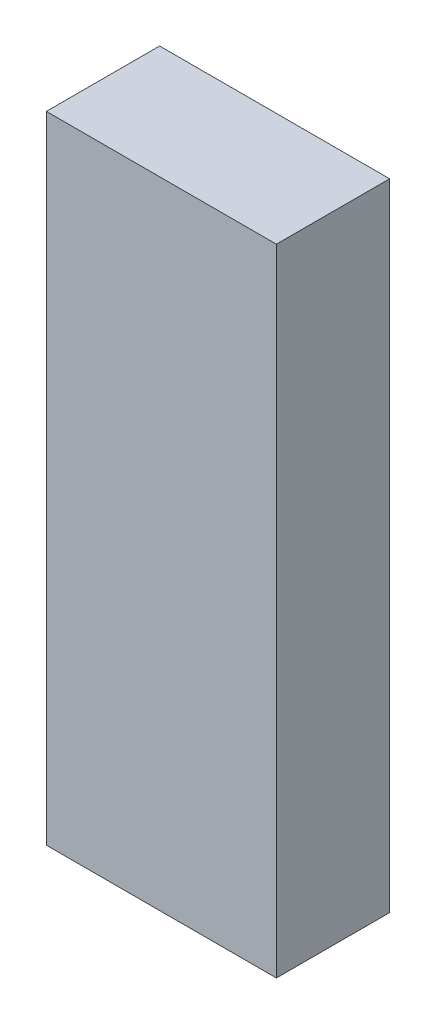
ISO-10303-21;
HEADER;
FILE_DESCRIPTION(('STEP AP214'),'2;1');
FILE_NAME('part.step','',(''),(''),'','','');
FILE_SCHEMA(('AUTOMOTIVE_DESIGN { 1 0 10303 214 1 1 1 1 }'));
ENDSEC;
DATA;
#1=APPLICATION_CONTEXT('core data for automotive mechanical design processes');
#2=APPLICATION_PROTOCOL_DEFINITION('international standard','automotive_design',2000,#1);
#3=PRODUCT_CONTEXT('',#1,'mechanical');
#4=PRODUCT('Part','Part','',(#3));
#5=PRODUCT_RELATED_PRODUCT_CATEGORY('part','',(#4));
#6=PRODUCT_DEFINITION_FORMATION('','',#4);
#7=PRODUCT_DEFINITION_CONTEXT('part definition',#1,'design');
#8=PRODUCT_DEFINITION('design','',#6,#7);
#9=PRODUCT_DEFINITION_SHAPE('','',#8);
#10=(LENGTH_UNIT() NAMED_UNIT(*) SI_UNIT(.MILLI.,.METRE.));
#11=(NAMED_UNIT(*) PLANE_ANGLE_UNIT() SI_UNIT($,.RADIAN.));
#12=(NAMED_UNIT(*) SI_UNIT($,.STERADIAN.) SOLID_ANGLE_UNIT());
#13=UNCERTAINTY_MEASURE_WITH_UNIT(LENGTH_MEASURE(1.E-05),#10,'distance_accuracy_value','');
#14=(GEOMETRIC_REPRESENTATION_CONTEXT(3) GLOBAL_UNCERTAINTY_ASSIGNED_CONTEXT((#13)) GLOBAL_UNIT_ASSIGNED_CONTEXT((#10,
#11,#12)) REPRESENTATION_CONTEXT('',''));
#15=CARTESIAN_POINT('',(0.,0.,0.));
#16=DIRECTION('',(0.,0.,1.));
#17=DIRECTION('',(1.,0.,0.));
#18=AXIS2_PLACEMENT_3D('',#15,#16,#17);
#19=CARTESIAN_POINT('',(-0.32500316,0.45719492,0.31999936));
#20=DIRECTION('',(0.,0.,-1.));
#21=DIRECTION('',(-1.,0.,0.));
#22=AXIS2_PLACEMENT_3D('',#19,#20,#21);
#23=PLANE('',#22);
#24=DIRECTION('',(0.,1.,0.));
#25=VECTOR('',#24,1.);
#26=CARTESIAN_POINT('',(0.32499808,-1.3386308,0.31999936));
#27=LINE('',#26,#25);
#28=CARTESIAN_POINT('',(0.32499808,-1.3386308,0.31999936));
#29=VERTEX_POINT('',#28);
#30=CARTESIAN_POINT('',(0.32499808,0.45719492,0.31999936));
#31=VERTEX_POINT('',#30);
#32=EDGE_CURVE('E79',#29,#31,#27,.T.);
#33=ORIENTED_EDGE('',*,*,#32,.T.);
#34=DIRECTION('',(1.,0.,0.));
#35=VECTOR('',#34,1.);
#36=CARTESIAN_POINT('',(0.32499808,0.45719492,0.31999936));
#37=LINE('',#36,#35);
#38=CARTESIAN_POINT('',(-0.32500316,0.45719492,0.31999936));
#39=VERTEX_POINT('',#38);
#40=EDGE_CURVE('E54',#31,#39,#37,.F.);
#41=ORIENTED_EDGE('',*,*,#40,.T.);
#42=DIRECTION('',(0.,1.,0.));
#43=VECTOR('',#42,1.);
#44=CARTESIAN_POINT('',(-0.32500316,0.45719492,0.31999936));
#45=LINE('',#44,#43);
#46=CARTESIAN_POINT('',(-0.32500316,-1.3386308,0.31999936));
#47=VERTEX_POINT('',#46);
#48=EDGE_CURVE('E56',#39,#47,#45,.F.);
#49=ORIENTED_EDGE('',*,*,#48,.T.);
#50=DIRECTION('',(1.,0.,0.));
#51=VECTOR('',#50,1.);
#52=CARTESIAN_POINT('',(-0.32500316,-1.3386308,0.31999936));
#53=LINE('',#52,#51);
#54=EDGE_CURVE('E19',#47,#29,#53,.T.);
#55=ORIENTED_EDGE('',*,*,#54,.T.);
#56=EDGE_LOOP('',(#33,#41,#49,#55));
#57=FACE_BOUND('',#56,.T.);
#58=ADVANCED_FACE('F16',(#57),#23,.F.);
#59=CARTESIAN_POINT('',(-0.32500316,-1.3386308,0.));
#60=DIRECTION('',(0.,1.,0.));
#61=DIRECTION('',(0.,0.,1.));
#62=AXIS2_PLACEMENT_3D('',#59,#60,#61);
#63=PLANE('',#62);
#64=ORIENTED_EDGE('',*,*,#54,.F.);
#65=DIRECTION('',(0.,0.,-1.));
#66=VECTOR('',#65,1.);
#67=CARTESIAN_POINT('',(-0.32500316,-1.3386308,0.));
#68=LINE('',#67,#66);
#69=CARTESIAN_POINT('',(-0.32500316,-1.3386308,0.));
#70=VERTEX_POINT('',#69);
#71=EDGE_CURVE('E62',#47,#70,#68,.T.);
#72=ORIENTED_EDGE('',*,*,#71,.T.);
#73=DIRECTION('',(-1.,0.,0.));
#74=VECTOR('',#73,1.);
#75=CARTESIAN_POINT('',(-0.32500316,-1.3386308,0.));
#76=LINE('',#75,#74);
#77=CARTESIAN_POINT('',(0.32499808,-1.3386308,0.));
#78=VERTEX_POINT('',#77);
#79=EDGE_CURVE('E82',#78,#70,#76,.T.);
#80=ORIENTED_EDGE('',*,*,#79,.F.);
#81=DIRECTION('',(0.,0.,1.));
#82=VECTOR('',#81,1.);
#83=CARTESIAN_POINT('',(0.32499808,-1.3386308,0.));
#84=LINE('',#83,#82);
#85=EDGE_CURVE('E67',#78,#29,#84,.T.);
#86=ORIENTED_EDGE('',*,*,#85,.T.);
#87=EDGE_LOOP('',(#64,#72,#80,#86));
#88=FACE_BOUND('',#87,.T.);
#89=ADVANCED_FACE('F64',(#88),#63,.F.);
#90=CARTESIAN_POINT('',(-0.32500316,0.45719492,0.));
#91=DIRECTION('',(1.,0.,0.));
#92=DIRECTION('',(0.,0.,-1.));
#93=AXIS2_PLACEMENT_3D('',#90,#91,#92);
#94=PLANE('',#93);
#95=ORIENTED_EDGE('',*,*,#48,.F.);
#96=DIRECTION('',(0.,0.,-1.));
#97=VECTOR('',#96,1.);
#98=CARTESIAN_POINT('',(-0.32500316,0.45719492,0.));
#99=LINE('',#98,#97);
#100=CARTESIAN_POINT('',(-0.32500316,0.45719492,0.));
#101=VERTEX_POINT('',#100);
#102=EDGE_CURVE('E74',#39,#101,#99,.T.);
#103=ORIENTED_EDGE('',*,*,#102,.T.);
#104=DIRECTION('',(0.,1.,0.));
#105=VECTOR('',#104,1.);
#106=CARTESIAN_POINT('',(-0.32500316,0.45719492,0.));
#107=LINE('',#106,#105);
#108=EDGE_CURVE('E71',#70,#101,#107,.T.);
#109=ORIENTED_EDGE('',*,*,#108,.F.);
#110=ORIENTED_EDGE('',*,*,#71,.F.);
#111=EDGE_LOOP('',(#95,#103,#109,#110));
#112=FACE_BOUND('',#111,.T.);
#113=ADVANCED_FACE('F69',(#112),#94,.F.);
#114=CARTESIAN_POINT('',(0.32499808,0.45719492,0.));
#115=DIRECTION('',(0.,-1.,0.));
#116=DIRECTION('',(0.,0.,-1.));
#117=AXIS2_PLACEMENT_3D('',#114,#115,#116);
#118=PLANE('',#117);
#119=ORIENTED_EDGE('',*,*,#40,.F.);
#120=DIRECTION('',(0.,0.,1.));
#121=VECTOR('',#120,1.);
#122=CARTESIAN_POINT('',(0.32499808,0.45719492,0.));
#123=LINE('',#122,#121);
#124=CARTESIAN_POINT('',(0.32499808,0.45719492,0.));
#125=VERTEX_POINT('',#124);
#126=EDGE_CURVE('E34',#31,#125,#123,.F.);
#127=ORIENTED_EDGE('',*,*,#126,.T.);
#128=DIRECTION('',(-1.,0.,0.));
#129=VECTOR('',#128,1.);
#130=CARTESIAN_POINT('',(-0.32500316,0.45719492,0.));
#131=LINE('',#130,#129);
#132=EDGE_CURVE('E25',#101,#125,#131,.F.);
#133=ORIENTED_EDGE('',*,*,#132,.F.);
#134=ORIENTED_EDGE('',*,*,#102,.F.);
#135=EDGE_LOOP('',(#119,#127,#133,#134));
#136=FACE_BOUND('',#135,.T.);
#137=ADVANCED_FACE('F88',(#136),#118,.F.);
#138=CARTESIAN_POINT('',(0.32499808,-1.3386308,0.));
#139=DIRECTION('',(-1.,0.,0.));
#140=DIRECTION('',(0.,0.,1.));
#141=AXIS2_PLACEMENT_3D('',#138,#139,#140);
#142=PLANE('',#141);
#143=ORIENTED_EDGE('',*,*,#32,.F.);
#144=ORIENTED_EDGE('',*,*,#85,.F.);
#145=DIRECTION('',(0.,1.,0.));
#146=VECTOR('',#145,1.);
#147=CARTESIAN_POINT('',(0.32499808,0.45719492,0.));
#148=LINE('',#147,#146);
#149=EDGE_CURVE('E11',#125,#78,#148,.F.);
#150=ORIENTED_EDGE('',*,*,#149,.F.);
#151=ORIENTED_EDGE('',*,*,#126,.F.);
#152=EDGE_LOOP('',(#143,#144,#150,#151));
#153=FACE_BOUND('',#152,.T.);
#154=ADVANCED_FACE('F90',(#153),#142,.F.);
#155=CARTESIAN_POINT('',(-0.32500316,0.45719492,0.));
#156=DIRECTION('',(0.,0.,-1.));
#157=DIRECTION('',(-1.,0.,0.));
#158=AXIS2_PLACEMENT_3D('',#155,#156,#157);
#159=PLANE('',#158);
#160=ORIENTED_EDGE('',*,*,#132,.T.);
#161=ORIENTED_EDGE('',*,*,#149,.T.);
#162=ORIENTED_EDGE('',*,*,#79,.T.);
#163=ORIENTED_EDGE('',*,*,#108,.T.);
#164=EDGE_LOOP('',(#160,#161,#162,#163));
#165=FACE_BOUND('',#164,.T.);
#166=ADVANCED_FACE('F87',(#165),#159,.T.);
#167=CLOSED_SHELL('',(#58,#89,#113,#137,#154,#166));
#168=MANIFOLD_SOLID_BREP('B1',#167);
#169=ADVANCED_BREP_SHAPE_REPRESENTATION('',(#18,#168),#14);
#170=SHAPE_DEFINITION_REPRESENTATION(#9,#169);
ENDSEC;
END-ISO-10303-21;
